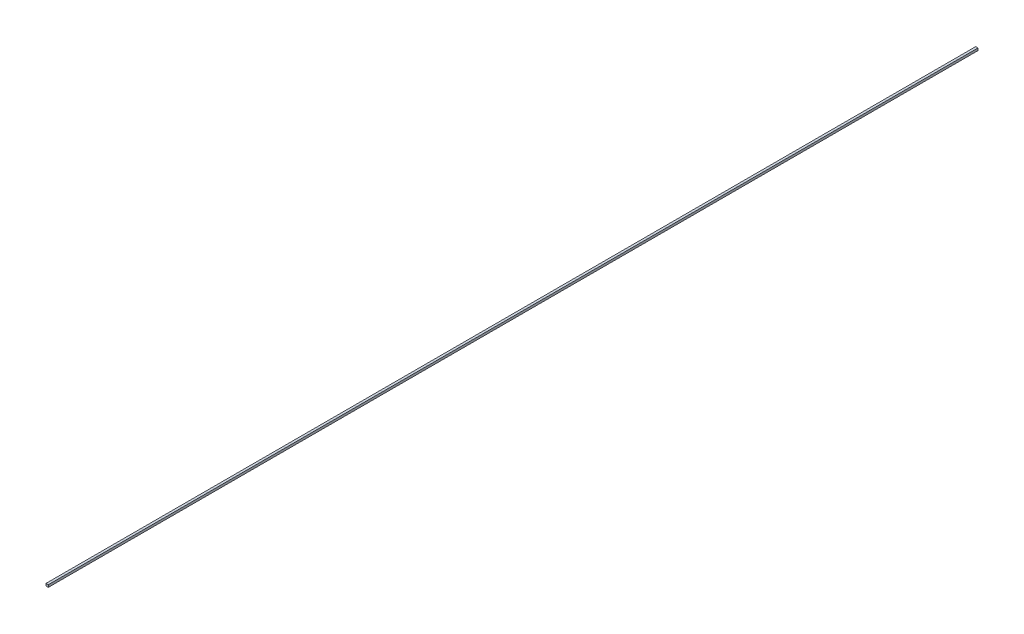
ISO-10303-21;
HEADER;
FILE_DESCRIPTION(('STEP AP214'),'2;1');
FILE_NAME('part.step','',(''),(''),'','','');
FILE_SCHEMA(('AUTOMOTIVE_DESIGN { 1 0 10303 214 1 1 1 1 }'));
ENDSEC;
DATA;
#1=APPLICATION_CONTEXT('core data for automotive mechanical design processes');
#2=APPLICATION_PROTOCOL_DEFINITION('international standard','automotive_design',2000,#1);
#3=PRODUCT_CONTEXT('',#1,'mechanical');
#4=PRODUCT('Part','Part','',(#3));
#5=PRODUCT_RELATED_PRODUCT_CATEGORY('part','',(#4));
#6=PRODUCT_DEFINITION_FORMATION('','',#4);
#7=PRODUCT_DEFINITION_CONTEXT('part definition',#1,'design');
#8=PRODUCT_DEFINITION('design','',#6,#7);
#9=PRODUCT_DEFINITION_SHAPE('','',#8);
#10=(LENGTH_UNIT() NAMED_UNIT(*) SI_UNIT(.MILLI.,.METRE.));
#11=(NAMED_UNIT(*) PLANE_ANGLE_UNIT() SI_UNIT($,.RADIAN.));
#12=(NAMED_UNIT(*) SI_UNIT($,.STERADIAN.) SOLID_ANGLE_UNIT());
#13=UNCERTAINTY_MEASURE_WITH_UNIT(LENGTH_MEASURE(1.E-05),#10,'distance_accuracy_value','');
#14=(GEOMETRIC_REPRESENTATION_CONTEXT(3) GLOBAL_UNCERTAINTY_ASSIGNED_CONTEXT((#13)) GLOBAL_UNIT_ASSIGNED_CONTEXT((#10,
#11,#12)) REPRESENTATION_CONTEXT('',''));
#15=CARTESIAN_POINT('',(0.,0.,0.));
#16=DIRECTION('',(0.,0.,1.));
#17=DIRECTION('',(1.,0.,0.));
#18=AXIS2_PLACEMENT_3D('',#15,#16,#17);
#19=CARTESIAN_POINT('',(1.5,1.5,1200.));
#20=DIRECTION('',(-1.,0.,0.));
#21=DIRECTION('',(0.,-1.,0.));
#22=AXIS2_PLACEMENT_3D('',#19,#20,#21);
#23=PLANE('',#22);
#24=DIRECTION('',(0.,1.,0.));
#25=VECTOR('',#24,1.);
#26=CARTESIAN_POINT('',(1.5,1.5,0.));
#27=LINE('',#26,#25);
#28=CARTESIAN_POINT('',(1.5,-1.5,0.));
#29=VERTEX_POINT('',#28);
#30=CARTESIAN_POINT('',(1.5,1.5,0.));
#31=VERTEX_POINT('',#30);
#32=EDGE_CURVE('E111',#29,#31,#27,.T.);
#33=ORIENTED_EDGE('',*,*,#32,.T.);
#34=DIRECTION('',(0.,0.,-1.));
#35=VECTOR('',#34,1.);
#36=CARTESIAN_POINT('',(1.5,1.5,1200.));
#37=LINE('',#36,#35);
#38=CARTESIAN_POINT('',(1.5,1.5,1200.));
#39=VERTEX_POINT('',#38);
#40=EDGE_CURVE('E11',#39,#31,#37,.T.);
#41=ORIENTED_EDGE('',*,*,#40,.F.);
#42=DIRECTION('',(0.,1.,0.));
#43=VECTOR('',#42,1.);
#44=CARTESIAN_POINT('',(1.5,1.5,1200.));
#45=LINE('',#44,#43);
#46=CARTESIAN_POINT('',(1.5,-1.5,1200.));
#47=VERTEX_POINT('',#46);
#48=EDGE_CURVE('E95',#47,#39,#45,.T.);
#49=ORIENTED_EDGE('',*,*,#48,.F.);
#50=DIRECTION('',(0.,0.,-1.));
#51=VECTOR('',#50,1.);
#52=CARTESIAN_POINT('',(1.5,-1.5,1200.));
#53=LINE('',#52,#51);
#54=EDGE_CURVE('E107',#47,#29,#53,.T.);
#55=ORIENTED_EDGE('',*,*,#54,.T.);
#56=EDGE_LOOP('',(#33,#41,#49,#55));
#57=FACE_BOUND('',#56,.T.);
#58=ADVANCED_FACE('F43',(#57),#23,.F.);
#59=CARTESIAN_POINT('',(-1.5,1.5,1200.));
#60=DIRECTION('',(0.,-1.,0.));
#61=DIRECTION('',(0.,0.,-1.));
#62=AXIS2_PLACEMENT_3D('',#59,#60,#61);
#63=PLANE('',#62);
#64=DIRECTION('',(-1.,0.,0.));
#65=VECTOR('',#64,1.);
#66=CARTESIAN_POINT('',(-1.5,1.5,0.));
#67=LINE('',#66,#65);
#68=CARTESIAN_POINT('',(-1.5,1.5,0.));
#69=VERTEX_POINT('',#68);
#70=EDGE_CURVE('E100',#31,#69,#67,.T.);
#71=ORIENTED_EDGE('',*,*,#70,.T.);
#72=DIRECTION('',(0.,0.,-1.));
#73=VECTOR('',#72,1.);
#74=CARTESIAN_POINT('',(-1.5,1.5,1200.));
#75=LINE('',#74,#73);
#76=CARTESIAN_POINT('',(-1.5,1.5,1200.));
#77=VERTEX_POINT('',#76);
#78=EDGE_CURVE('E52',#77,#69,#75,.T.);
#79=ORIENTED_EDGE('',*,*,#78,.F.);
#80=DIRECTION('',(-1.,0.,0.));
#81=VECTOR('',#80,1.);
#82=CARTESIAN_POINT('',(-1.5,1.5,1200.));
#83=LINE('',#82,#81);
#84=EDGE_CURVE('E90',#39,#77,#83,.T.);
#85=ORIENTED_EDGE('',*,*,#84,.F.);
#86=ORIENTED_EDGE('',*,*,#40,.T.);
#87=EDGE_LOOP('',(#71,#79,#85,#86));
#88=FACE_BOUND('',#87,.T.);
#89=ADVANCED_FACE('F99',(#88),#63,.F.);
#90=CARTESIAN_POINT('',(-1.5,1.5,1200.));
#91=DIRECTION('',(1.,0.,0.));
#92=DIRECTION('',(0.,1.,0.));
#93=AXIS2_PLACEMENT_3D('',#90,#91,#92);
#94=PLANE('',#93);
#95=DIRECTION('',(0.,-1.,0.));
#96=VECTOR('',#95,1.);
#97=CARTESIAN_POINT('',(-1.5,1.5,0.));
#98=LINE('',#97,#96);
#99=CARTESIAN_POINT('',(-1.5,-1.5,0.));
#100=VERTEX_POINT('',#99);
#101=EDGE_CURVE('E77',#69,#100,#98,.T.);
#102=ORIENTED_EDGE('',*,*,#101,.T.);
#103=DIRECTION('',(0.,0.,-1.));
#104=VECTOR('',#103,1.);
#105=CARTESIAN_POINT('',(-1.5,-1.5,1200.));
#106=LINE('',#105,#104);
#107=CARTESIAN_POINT('',(-1.5,-1.5,1200.));
#108=VERTEX_POINT('',#107);
#109=EDGE_CURVE('E102',#108,#100,#106,.T.);
#110=ORIENTED_EDGE('',*,*,#109,.F.);
#111=DIRECTION('',(0.,-1.,0.));
#112=VECTOR('',#111,1.);
#113=CARTESIAN_POINT('',(-1.5,1.5,1200.));
#114=LINE('',#113,#112);
#115=EDGE_CURVE('E93',#77,#108,#114,.T.);
#116=ORIENTED_EDGE('',*,*,#115,.F.);
#117=ORIENTED_EDGE('',*,*,#78,.T.);
#118=EDGE_LOOP('',(#102,#110,#116,#117));
#119=FACE_BOUND('',#118,.T.);
#120=ADVANCED_FACE('F103',(#119),#94,.F.);
#121=CARTESIAN_POINT('',(-1.5,-1.5,1200.));
#122=DIRECTION('',(0.,1.,0.));
#123=DIRECTION('',(0.,0.,1.));
#124=AXIS2_PLACEMENT_3D('',#121,#122,#123);
#125=PLANE('',#124);
#126=DIRECTION('',(1.,0.,0.));
#127=VECTOR('',#126,1.);
#128=CARTESIAN_POINT('',(-1.5,-1.5,0.));
#129=LINE('',#128,#127);
#130=EDGE_CURVE('E83',#100,#29,#129,.T.);
#131=ORIENTED_EDGE('',*,*,#130,.T.);
#132=ORIENTED_EDGE('',*,*,#54,.F.);
#133=DIRECTION('',(1.,0.,0.));
#134=VECTOR('',#133,1.);
#135=CARTESIAN_POINT('',(-1.5,-1.5,1200.));
#136=LINE('',#135,#134);
#137=EDGE_CURVE('E60',#108,#47,#136,.T.);
#138=ORIENTED_EDGE('',*,*,#137,.F.);
#139=ORIENTED_EDGE('',*,*,#109,.T.);
#140=EDGE_LOOP('',(#131,#132,#138,#139));
#141=FACE_BOUND('',#140,.T.);
#142=ADVANCED_FACE('F124',(#141),#125,.F.);
#143=CARTESIAN_POINT('',(0.,0.,1200.));
#144=DIRECTION('',(0.,0.,1.));
#145=DIRECTION('',(1.,0.,0.));
#146=AXIS2_PLACEMENT_3D('',#143,#144,#145);
#147=PLANE('',#146);
#148=ORIENTED_EDGE('',*,*,#48,.T.);
#149=ORIENTED_EDGE('',*,*,#84,.T.);
#150=ORIENTED_EDGE('',*,*,#115,.T.);
#151=ORIENTED_EDGE('',*,*,#137,.T.);
#152=EDGE_LOOP('',(#148,#149,#150,#151));
#153=FACE_BOUND('',#152,.T.);
#154=ADVANCED_FACE('F91',(#153),#147,.T.);
#155=CARTESIAN_POINT('',(0.,0.,0.));
#156=DIRECTION('',(0.,0.,1.));
#157=DIRECTION('',(1.,0.,0.));
#158=AXIS2_PLACEMENT_3D('',#155,#156,#157);
#159=PLANE('',#158);
#160=ORIENTED_EDGE('',*,*,#32,.F.);
#161=ORIENTED_EDGE('',*,*,#130,.F.);
#162=ORIENTED_EDGE('',*,*,#101,.F.);
#163=ORIENTED_EDGE('',*,*,#70,.F.);
#164=EDGE_LOOP('',(#160,#161,#162,#163));
#165=FACE_BOUND('',#164,.T.);
#166=ADVANCED_FACE('F127',(#165),#159,.F.);
#167=CLOSED_SHELL('',(#58,#89,#120,#142,#154,#166));
#168=MANIFOLD_SOLID_BREP('B2',#167);
#169=ADVANCED_BREP_SHAPE_REPRESENTATION('',(#18,#168),#14);
#170=SHAPE_DEFINITION_REPRESENTATION(#9,#169);
ENDSEC;
END-ISO-10303-21;
